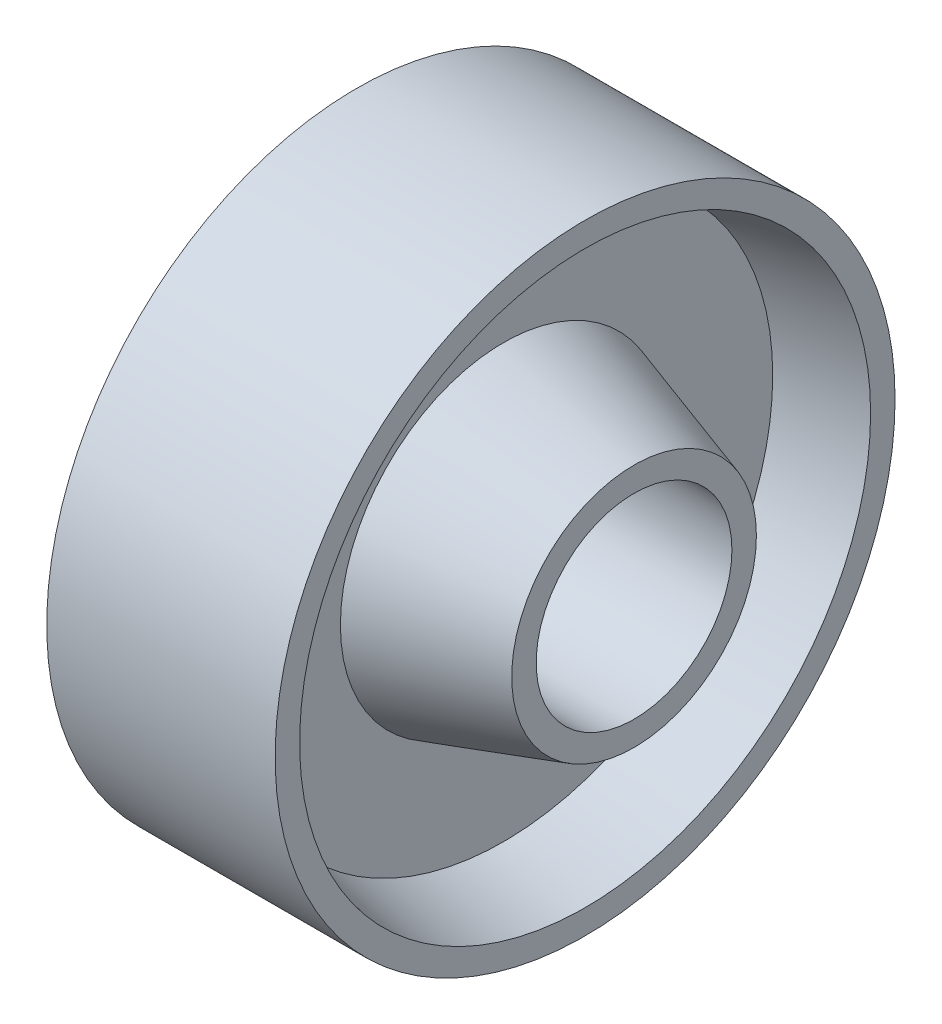
ISO-10303-21;
HEADER;
FILE_DESCRIPTION(('STEP AP214'),'2;1');
FILE_NAME('part.step','',(''),(''),'','','');
FILE_SCHEMA(('AUTOMOTIVE_DESIGN { 1 0 10303 214 1 1 1 1 }'));
ENDSEC;
DATA;
#1=APPLICATION_CONTEXT('core data for automotive mechanical design processes');
#2=APPLICATION_PROTOCOL_DEFINITION('international standard','automotive_design',2000,#1);
#3=PRODUCT_CONTEXT('',#1,'mechanical');
#4=PRODUCT('Part','Part','',(#3));
#5=PRODUCT_RELATED_PRODUCT_CATEGORY('part','',(#4));
#6=PRODUCT_DEFINITION_FORMATION('','',#4);
#7=PRODUCT_DEFINITION_CONTEXT('part definition',#1,'design');
#8=PRODUCT_DEFINITION('design','',#6,#7);
#9=PRODUCT_DEFINITION_SHAPE('','',#8);
#10=(LENGTH_UNIT() NAMED_UNIT(*) SI_UNIT(.MILLI.,.METRE.));
#11=(NAMED_UNIT(*) PLANE_ANGLE_UNIT() SI_UNIT($,.RADIAN.));
#12=(NAMED_UNIT(*) SI_UNIT($,.STERADIAN.) SOLID_ANGLE_UNIT());
#13=UNCERTAINTY_MEASURE_WITH_UNIT(LENGTH_MEASURE(1.E-05),#10,'distance_accuracy_value','');
#14=(GEOMETRIC_REPRESENTATION_CONTEXT(3) GLOBAL_UNCERTAINTY_ASSIGNED_CONTEXT((#13)) GLOBAL_UNIT_ASSIGNED_CONTEXT((#10,
#11,#12)) REPRESENTATION_CONTEXT('',''));
#15=CARTESIAN_POINT('',(0.,0.,0.));
#16=DIRECTION('',(0.,0.,1.));
#17=DIRECTION('',(1.,0.,0.));
#18=AXIS2_PLACEMENT_3D('',#15,#16,#17);
#19=CARTESIAN_POINT('',(24.2798833819242,0.,0.));
#20=DIRECTION('',(1.,0.,0.));
#21=DIRECTION('',(0.,0.,-1.));
#22=AXIS2_PLACEMENT_3D('',#19,#20,#21);
#23=CYLINDRICAL_SURFACE('',#22,12.);
#24=CARTESIAN_POINT('',(20.,0.,0.));
#25=DIRECTION('',(1.,0.,0.));
#26=DIRECTION('',(0.,0.,-1.));
#27=AXIS2_PLACEMENT_3D('',#24,#25,#26);
#28=CIRCLE('',#27,12.);
#29=CARTESIAN_POINT('',(20.,0.,-12.));
#30=VERTEX_POINT('',#29);
#31=EDGE_CURVE('E74',#30,#30,#28,.T.);
#32=ORIENTED_EDGE('',*,*,#31,.T.);
#33=EDGE_LOOP('',(#32));
#34=FACE_BOUND('',#33,.T.);
#35=CARTESIAN_POINT('',(-20.,0.,0.));
#36=DIRECTION('',(1.,0.,0.));
#37=DIRECTION('',(0.,0.,-1.));
#38=AXIS2_PLACEMENT_3D('',#35,#36,#37);
#39=CIRCLE('',#38,12.);
#40=CARTESIAN_POINT('',(-20.,0.,-12.));
#41=VERTEX_POINT('',#40);
#42=EDGE_CURVE('E10',#41,#41,#39,.T.);
#43=ORIENTED_EDGE('',*,*,#42,.F.);
#44=EDGE_LOOP('',(#43));
#45=FACE_BOUND('',#44,.T.);
#46=ADVANCED_FACE('F34',(#34,#45),#23,.F.);
#47=CARTESIAN_POINT('',(-20.,12.,0.));
#48=DIRECTION('',(-1.,0.,0.));
#49=DIRECTION('',(0.,0.,1.));
#50=AXIS2_PLACEMENT_3D('',#47,#48,#49);
#51=PLANE('',#50);
#52=ORIENTED_EDGE('',*,*,#42,.T.);
#53=EDGE_LOOP('',(#52));
#54=FACE_BOUND('',#53,.T.);
#55=CARTESIAN_POINT('',(-20.,0.,0.));
#56=DIRECTION('',(1.,0.,0.));
#57=DIRECTION('',(0.,0.,-1.));
#58=AXIS2_PLACEMENT_3D('',#55,#56,#57);
#59=CIRCLE('',#58,15.);
#60=CARTESIAN_POINT('',(-20.,0.,-15.));
#61=VERTEX_POINT('',#60);
#62=EDGE_CURVE('E40',#61,#61,#59,.T.);
#63=ORIENTED_EDGE('',*,*,#62,.F.);
#64=EDGE_LOOP('',(#63));
#65=FACE_BOUND('',#64,.T.);
#66=ADVANCED_FACE('F92',(#54,#65),#51,.T.);
#67=CARTESIAN_POINT('',(-4.,0.,0.));
#68=DIRECTION('',(1.,0.,0.));
#69=DIRECTION('',(0.,0.,-1.));
#70=AXIS2_PLACEMENT_3D('',#67,#68,#69);
#71=CONICAL_SURFACE('',#70,20.,0.302884868374971);
#72=ORIENTED_EDGE('',*,*,#62,.T.);
#73=EDGE_LOOP('',(#72));
#74=FACE_BOUND('',#73,.T.);
#75=CARTESIAN_POINT('',(-4.,0.,0.));
#76=DIRECTION('',(1.,0.,0.));
#77=DIRECTION('',(0.,0.,-1.));
#78=AXIS2_PLACEMENT_3D('',#75,#76,#77);
#79=CIRCLE('',#78,20.);
#80=CARTESIAN_POINT('',(-4.,0.,-20.));
#81=VERTEX_POINT('',#80);
#82=EDGE_CURVE('E44',#81,#81,#79,.T.);
#83=ORIENTED_EDGE('',*,*,#82,.F.);
#84=EDGE_LOOP('',(#83));
#85=FACE_BOUND('',#84,.T.);
#86=ADVANCED_FACE('F96',(#74,#85),#71,.T.);
#87=CARTESIAN_POINT('',(-4.,20.,0.));
#88=DIRECTION('',(-1.,0.,0.));
#89=DIRECTION('',(0.,0.,1.));
#90=AXIS2_PLACEMENT_3D('',#87,#88,#89);
#91=PLANE('',#90);
#92=ORIENTED_EDGE('',*,*,#82,.T.);
#93=EDGE_LOOP('',(#92));
#94=FACE_BOUND('',#93,.T.);
#95=CARTESIAN_POINT('',(-4.,0.,0.));
#96=DIRECTION('',(1.,0.,0.));
#97=DIRECTION('',(0.,0.,-1.));
#98=AXIS2_PLACEMENT_3D('',#95,#96,#97);
#99=CIRCLE('',#98,33.);
#100=CARTESIAN_POINT('',(-4.,0.,-33.));
#101=VERTEX_POINT('',#100);
#102=EDGE_CURVE('E48',#101,#101,#99,.T.);
#103=ORIENTED_EDGE('',*,*,#102,.F.);
#104=EDGE_LOOP('',(#103));
#105=FACE_BOUND('',#104,.T.);
#106=ADVANCED_FACE('F100',(#94,#105),#91,.T.);
#107=CARTESIAN_POINT('',(-14.,0.,0.));
#108=DIRECTION('',(-1.,0.,0.));
#109=DIRECTION('',(0.,0.,1.));
#110=AXIS2_PLACEMENT_3D('',#107,#108,#109);
#111=CONICAL_SURFACE('',#110,35.,0.19739555984988);
#112=ORIENTED_EDGE('',*,*,#102,.T.);
#113=EDGE_LOOP('',(#112));
#114=FACE_BOUND('',#113,.T.);
#115=CARTESIAN_POINT('',(-14.,0.,0.));
#116=DIRECTION('',(1.,0.,0.));
#117=DIRECTION('',(0.,0.,-1.));
#118=AXIS2_PLACEMENT_3D('',#115,#116,#117);
#119=CIRCLE('',#118,35.);
#120=CARTESIAN_POINT('',(-14.,0.,-35.));
#121=VERTEX_POINT('',#120);
#122=EDGE_CURVE('E53',#121,#121,#119,.T.);
#123=ORIENTED_EDGE('',*,*,#122,.F.);
#124=EDGE_LOOP('',(#123));
#125=FACE_BOUND('',#124,.T.);
#126=ADVANCED_FACE('F106',(#114,#125),#111,.F.);
#127=CARTESIAN_POINT('',(-14.,35.,0.));
#128=DIRECTION('',(-1.,0.,0.));
#129=DIRECTION('',(0.,0.,1.));
#130=AXIS2_PLACEMENT_3D('',#127,#128,#129);
#131=PLANE('',#130);
#132=ORIENTED_EDGE('',*,*,#122,.T.);
#133=EDGE_LOOP('',(#132));
#134=FACE_BOUND('',#133,.T.);
#135=CARTESIAN_POINT('',(-14.,0.,0.));
#136=DIRECTION('',(1.,0.,0.));
#137=DIRECTION('',(0.,0.,-1.));
#138=AXIS2_PLACEMENT_3D('',#135,#136,#137);
#139=CIRCLE('',#138,38.);
#140=CARTESIAN_POINT('',(-14.,0.,-38.));
#141=VERTEX_POINT('',#140);
#142=EDGE_CURVE('E56',#141,#141,#139,.T.);
#143=ORIENTED_EDGE('',*,*,#142,.F.);
#144=EDGE_LOOP('',(#143));
#145=FACE_BOUND('',#144,.T.);
#146=ADVANCED_FACE('F110',(#134,#145),#131,.T.);
#147=CARTESIAN_POINT('',(24.2798833819242,0.,0.));
#148=DIRECTION('',(1.,0.,0.));
#149=DIRECTION('',(0.,0.,-1.));
#150=AXIS2_PLACEMENT_3D('',#147,#148,#149);
#151=CYLINDRICAL_SURFACE('',#150,38.);
#152=ORIENTED_EDGE('',*,*,#142,.T.);
#153=EDGE_LOOP('',(#152));
#154=FACE_BOUND('',#153,.T.);
#155=CARTESIAN_POINT('',(14.,0.,0.));
#156=DIRECTION('',(1.,0.,0.));
#157=DIRECTION('',(0.,0.,-1.));
#158=AXIS2_PLACEMENT_3D('',#155,#156,#157);
#159=CIRCLE('',#158,38.);
#160=CARTESIAN_POINT('',(14.,0.,-38.));
#161=VERTEX_POINT('',#160);
#162=EDGE_CURVE('E59',#161,#161,#159,.T.);
#163=ORIENTED_EDGE('',*,*,#162,.F.);
#164=EDGE_LOOP('',(#163));
#165=FACE_BOUND('',#164,.T.);
#166=ADVANCED_FACE('F114',(#154,#165),#151,.T.);
#167=CARTESIAN_POINT('',(14.,35.,0.));
#168=DIRECTION('',(1.,0.,0.));
#169=DIRECTION('',(0.,0.,-1.));
#170=AXIS2_PLACEMENT_3D('',#167,#168,#169);
#171=PLANE('',#170);
#172=ORIENTED_EDGE('',*,*,#162,.T.);
#173=EDGE_LOOP('',(#172));
#174=FACE_BOUND('',#173,.T.);
#175=CARTESIAN_POINT('',(14.,0.,0.));
#176=DIRECTION('',(1.,0.,0.));
#177=DIRECTION('',(0.,0.,-1.));
#178=AXIS2_PLACEMENT_3D('',#175,#176,#177);
#179=CIRCLE('',#178,35.);
#180=CARTESIAN_POINT('',(14.,0.,-35.));
#181=VERTEX_POINT('',#180);
#182=EDGE_CURVE('E62',#181,#181,#179,.T.);
#183=ORIENTED_EDGE('',*,*,#182,.F.);
#184=EDGE_LOOP('',(#183));
#185=FACE_BOUND('',#184,.T.);
#186=ADVANCED_FACE('F118',(#174,#185),#171,.T.);
#187=CARTESIAN_POINT('',(4.,0.,0.));
#188=DIRECTION('',(1.,0.,0.));
#189=DIRECTION('',(0.,0.,-1.));
#190=AXIS2_PLACEMENT_3D('',#187,#188,#189);
#191=CONICAL_SURFACE('',#190,33.,0.19739555984988);
#192=ORIENTED_EDGE('',*,*,#182,.T.);
#193=EDGE_LOOP('',(#192));
#194=FACE_BOUND('',#193,.T.);
#195=CARTESIAN_POINT('',(4.,0.,0.));
#196=DIRECTION('',(1.,0.,0.));
#197=DIRECTION('',(0.,0.,-1.));
#198=AXIS2_PLACEMENT_3D('',#195,#196,#197);
#199=CIRCLE('',#198,33.);
#200=CARTESIAN_POINT('',(4.,0.,-33.));
#201=VERTEX_POINT('',#200);
#202=EDGE_CURVE('E65',#201,#201,#199,.T.);
#203=ORIENTED_EDGE('',*,*,#202,.F.);
#204=EDGE_LOOP('',(#203));
#205=FACE_BOUND('',#204,.T.);
#206=ADVANCED_FACE('F122',(#194,#205),#191,.F.);
#207=CARTESIAN_POINT('',(4.,20.,0.));
#208=DIRECTION('',(1.,0.,0.));
#209=DIRECTION('',(0.,0.,-1.));
#210=AXIS2_PLACEMENT_3D('',#207,#208,#209);
#211=PLANE('',#210);
#212=ORIENTED_EDGE('',*,*,#202,.T.);
#213=EDGE_LOOP('',(#212));
#214=FACE_BOUND('',#213,.T.);
#215=CARTESIAN_POINT('',(4.,0.,0.));
#216=DIRECTION('',(1.,0.,0.));
#217=DIRECTION('',(0.,0.,-1.));
#218=AXIS2_PLACEMENT_3D('',#215,#216,#217);
#219=CIRCLE('',#218,20.);
#220=CARTESIAN_POINT('',(4.,0.,-20.));
#221=VERTEX_POINT('',#220);
#222=EDGE_CURVE('E68',#221,#221,#219,.T.);
#223=ORIENTED_EDGE('',*,*,#222,.F.);
#224=EDGE_LOOP('',(#223));
#225=FACE_BOUND('',#224,.T.);
#226=ADVANCED_FACE('F88',(#214,#225),#211,.T.);
#227=CARTESIAN_POINT('',(20.,0.,0.));
#228=DIRECTION('',(-1.,0.,0.));
#229=DIRECTION('',(0.,0.,1.));
#230=AXIS2_PLACEMENT_3D('',#227,#228,#229);
#231=CONICAL_SURFACE('',#230,15.,0.302884868374971);
#232=ORIENTED_EDGE('',*,*,#222,.T.);
#233=EDGE_LOOP('',(#232));
#234=FACE_BOUND('',#233,.T.);
#235=CARTESIAN_POINT('',(20.,0.,0.));
#236=DIRECTION('',(1.,0.,0.));
#237=DIRECTION('',(0.,0.,-1.));
#238=AXIS2_PLACEMENT_3D('',#235,#236,#237);
#239=CIRCLE('',#238,15.);
#240=CARTESIAN_POINT('',(20.,0.,-15.));
#241=VERTEX_POINT('',#240);
#242=EDGE_CURVE('E71',#241,#241,#239,.T.);
#243=ORIENTED_EDGE('',*,*,#242,.F.);
#244=EDGE_LOOP('',(#243));
#245=FACE_BOUND('',#244,.T.);
#246=ADVANCED_FACE('F82',(#234,#245),#231,.T.);
#247=CARTESIAN_POINT('',(20.,12.,0.));
#248=DIRECTION('',(1.,0.,0.));
#249=DIRECTION('',(0.,0.,-1.));
#250=AXIS2_PLACEMENT_3D('',#247,#248,#249);
#251=PLANE('',#250);
#252=ORIENTED_EDGE('',*,*,#242,.T.);
#253=EDGE_LOOP('',(#252));
#254=FACE_BOUND('',#253,.T.);
#255=ORIENTED_EDGE('',*,*,#31,.F.);
#256=EDGE_LOOP('',(#255));
#257=FACE_BOUND('',#256,.T.);
#258=ADVANCED_FACE('F80',(#254,#257),#251,.T.);
#259=CLOSED_SHELL('',(#46,#66,#86,#106,#126,#146,#166,#186,#206,#226,#246,#258));
#260=MANIFOLD_SOLID_BREP('B2',#259);
#261=ADVANCED_BREP_SHAPE_REPRESENTATION('',(#18,#260),#14);
#262=SHAPE_DEFINITION_REPRESENTATION(#9,#261);
ENDSEC;
END-ISO-10303-21;
